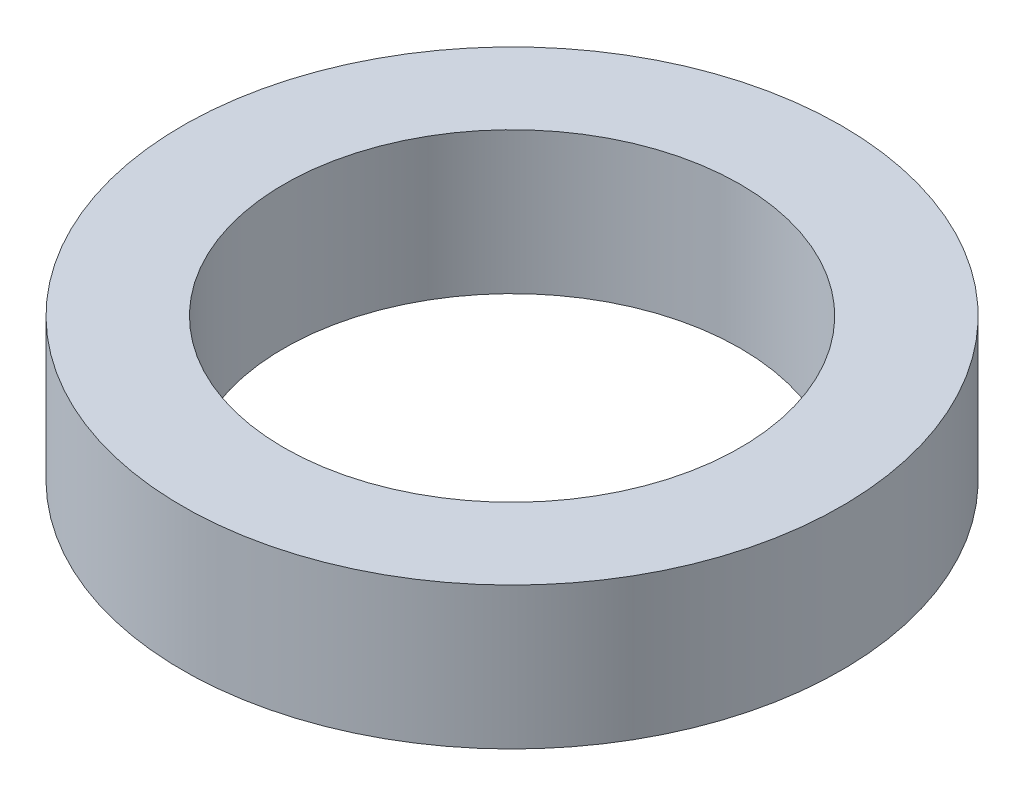
ISO-10303-21;
HEADER;
FILE_DESCRIPTION(('STEP AP214'),'2;1');
FILE_NAME('part.step','',(''),(''),'','','');
FILE_SCHEMA(('AUTOMOTIVE_DESIGN { 1 0 10303 214 1 1 1 1 }'));
ENDSEC;
DATA;
#1=APPLICATION_CONTEXT('core data for automotive mechanical design processes');
#2=APPLICATION_PROTOCOL_DEFINITION('international standard','automotive_design',2000,#1);
#3=PRODUCT_CONTEXT('',#1,'mechanical');
#4=PRODUCT('Part','Part','',(#3));
#5=PRODUCT_RELATED_PRODUCT_CATEGORY('part','',(#4));
#6=PRODUCT_DEFINITION_FORMATION('','',#4);
#7=PRODUCT_DEFINITION_CONTEXT('part definition',#1,'design');
#8=PRODUCT_DEFINITION('design','',#6,#7);
#9=PRODUCT_DEFINITION_SHAPE('','',#8);
#10=(LENGTH_UNIT() NAMED_UNIT(*) SI_UNIT(.MILLI.,.METRE.));
#11=(NAMED_UNIT(*) PLANE_ANGLE_UNIT() SI_UNIT($,.RADIAN.));
#12=(NAMED_UNIT(*) SI_UNIT($,.STERADIAN.) SOLID_ANGLE_UNIT());
#13=UNCERTAINTY_MEASURE_WITH_UNIT(LENGTH_MEASURE(1.E-05),#10,'distance_accuracy_value','');
#14=(GEOMETRIC_REPRESENTATION_CONTEXT(3) GLOBAL_UNCERTAINTY_ASSIGNED_CONTEXT((#13)) GLOBAL_UNIT_ASSIGNED_CONTEXT((#10,
#11,#12)) REPRESENTATION_CONTEXT('',''));
#15=CARTESIAN_POINT('',(0.,0.,0.));
#16=DIRECTION('',(0.,0.,1.));
#17=DIRECTION('',(1.,0.,0.));
#18=AXIS2_PLACEMENT_3D('',#15,#16,#17);
#19=CARTESIAN_POINT('',(0.,0.,0.));
#20=DIRECTION('',(0.,1.,0.));
#21=DIRECTION('',(0.,0.,1.));
#22=AXIS2_PLACEMENT_3D('',#19,#20,#21);
#23=PLANE('',#22);
#24=CARTESIAN_POINT('',(0.,0.,0.));
#25=DIRECTION('',(0.,-1.,0.));
#26=DIRECTION('',(0.,0.,-1.));
#27=AXIS2_PLACEMENT_3D('',#24,#25,#26);
#28=CIRCLE('',#27,22.5);
#29=CARTESIAN_POINT('',(0.,0.,-22.5));
#30=VERTEX_POINT('',#29);
#31=EDGE_CURVE('E27',#30,#30,#28,.F.);
#32=ORIENTED_EDGE('',*,*,#31,.T.);
#33=EDGE_LOOP('',(#32));
#34=FACE_BOUND('',#33,.T.);
#35=CARTESIAN_POINT('',(0.,0.,0.));
#36=DIRECTION('',(0.,-1.,0.));
#37=DIRECTION('',(0.,0.,-1.));
#38=AXIS2_PLACEMENT_3D('',#35,#36,#37);
#39=CIRCLE('',#38,32.5);
#40=CARTESIAN_POINT('',(0.,0.,-32.5));
#41=VERTEX_POINT('',#40);
#42=EDGE_CURVE('E18',#41,#41,#39,.F.);
#43=ORIENTED_EDGE('',*,*,#42,.F.);
#44=EDGE_LOOP('',(#43));
#45=FACE_BOUND('',#44,.T.);
#46=ADVANCED_FACE('F15',(#34,#45),#23,.F.);
#47=CARTESIAN_POINT('',(0.,14.,0.));
#48=DIRECTION('',(0.,-1.,0.));
#49=DIRECTION('',(0.,0.,-1.));
#50=AXIS2_PLACEMENT_3D('',#47,#48,#49);
#51=CYLINDRICAL_SURFACE('',#50,32.5);
#52=ORIENTED_EDGE('',*,*,#42,.T.);
#53=EDGE_LOOP('',(#52));
#54=FACE_BOUND('',#53,.T.);
#55=CARTESIAN_POINT('',(0.,14.,0.));
#56=DIRECTION('',(0.,-1.,0.));
#57=DIRECTION('',(0.,0.,-1.));
#58=AXIS2_PLACEMENT_3D('',#55,#56,#57);
#59=CIRCLE('',#58,32.5);
#60=CARTESIAN_POINT('',(0.,14.,-32.5));
#61=VERTEX_POINT('',#60);
#62=EDGE_CURVE('E22',#61,#61,#59,.F.);
#63=ORIENTED_EDGE('',*,*,#62,.F.);
#64=EDGE_LOOP('',(#63));
#65=FACE_BOUND('',#64,.T.);
#66=ADVANCED_FACE('F35',(#54,#65),#51,.T.);
#67=CARTESIAN_POINT('',(0.,14.,0.));
#68=DIRECTION('',(0.,-1.,0.));
#69=DIRECTION('',(0.,0.,-1.));
#70=AXIS2_PLACEMENT_3D('',#67,#68,#69);
#71=CYLINDRICAL_SURFACE('',#70,22.5);
#72=CARTESIAN_POINT('',(0.,14.,0.));
#73=DIRECTION('',(0.,-1.,0.));
#74=DIRECTION('',(0.,0.,-1.));
#75=AXIS2_PLACEMENT_3D('',#72,#73,#74);
#76=CIRCLE('',#75,22.5);
#77=CARTESIAN_POINT('',(0.,14.,-22.5));
#78=VERTEX_POINT('',#77);
#79=EDGE_CURVE('E10',#78,#78,#76,.T.);
#80=ORIENTED_EDGE('',*,*,#79,.F.);
#81=EDGE_LOOP('',(#80));
#82=FACE_BOUND('',#81,.T.);
#83=ORIENTED_EDGE('',*,*,#31,.F.);
#84=EDGE_LOOP('',(#83));
#85=FACE_BOUND('',#84,.T.);
#86=ADVANCED_FACE('F43',(#82,#85),#71,.F.);
#87=CARTESIAN_POINT('',(0.,14.,0.));
#88=DIRECTION('',(0.,1.,0.));
#89=DIRECTION('',(0.,0.,1.));
#90=AXIS2_PLACEMENT_3D('',#87,#88,#89);
#91=PLANE('',#90);
#92=ORIENTED_EDGE('',*,*,#79,.T.);
#93=EDGE_LOOP('',(#92));
#94=FACE_BOUND('',#93,.T.);
#95=ORIENTED_EDGE('',*,*,#62,.T.);
#96=EDGE_LOOP('',(#95));
#97=FACE_BOUND('',#96,.T.);
#98=ADVANCED_FACE('F44',(#94,#97),#91,.T.);
#99=CLOSED_SHELL('',(#46,#66,#86,#98));
#100=MANIFOLD_SOLID_BREP('B1',#99);
#101=ADVANCED_BREP_SHAPE_REPRESENTATION('',(#18,#100),#14);
#102=SHAPE_DEFINITION_REPRESENTATION(#9,#101);
ENDSEC;
END-ISO-10303-21;
